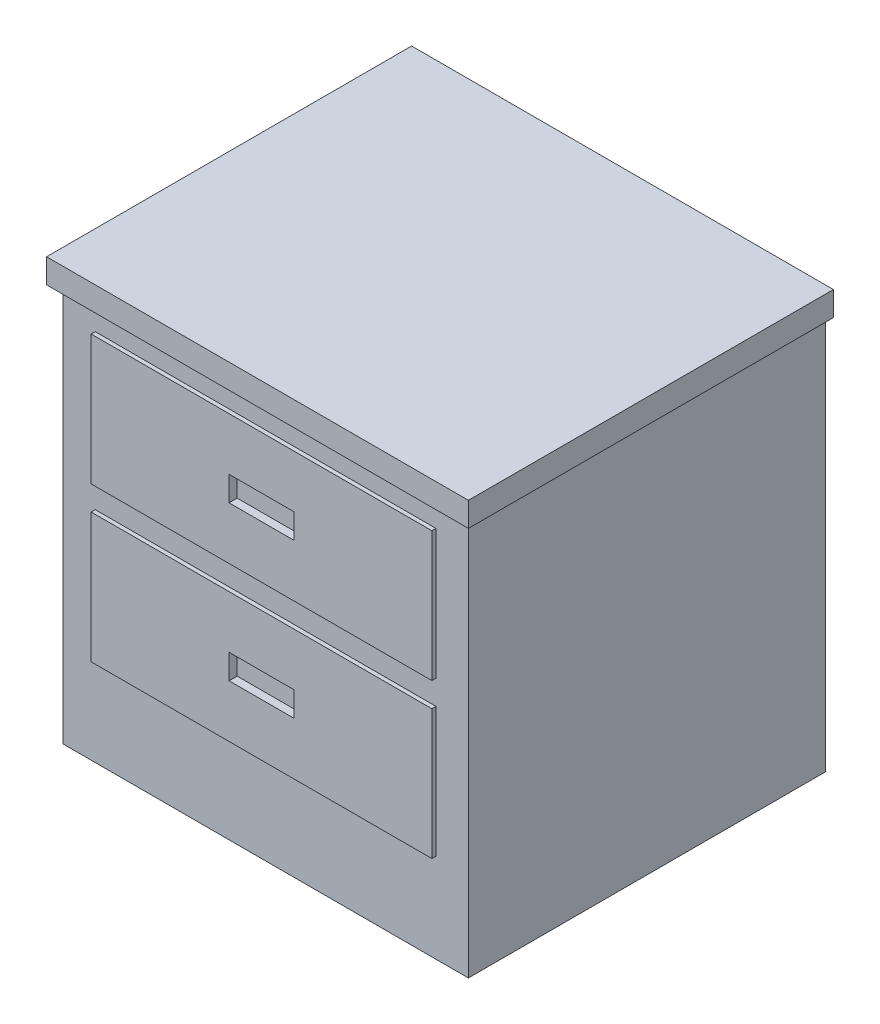
ISO-10303-21;
HEADER;
FILE_DESCRIPTION(('STEP AP214'),'2;1');
FILE_NAME('part.step','',(''),(''),'','','');
FILE_SCHEMA(('AUTOMOTIVE_DESIGN { 1 0 10303 214 1 1 1 1 }'));
ENDSEC;
DATA;
#1=APPLICATION_CONTEXT('core data for automotive mechanical design processes');
#2=APPLICATION_PROTOCOL_DEFINITION('international standard','automotive_design',2000,#1);
#3=PRODUCT_CONTEXT('',#1,'mechanical');
#4=PRODUCT('Part','Part','',(#3));
#5=PRODUCT_RELATED_PRODUCT_CATEGORY('part','',(#4));
#6=PRODUCT_DEFINITION_FORMATION('','',#4);
#7=PRODUCT_DEFINITION_CONTEXT('part definition',#1,'design');
#8=PRODUCT_DEFINITION('design','',#6,#7);
#9=PRODUCT_DEFINITION_SHAPE('','',#8);
#10=(LENGTH_UNIT() NAMED_UNIT(*) SI_UNIT(.MILLI.,.METRE.));
#11=(NAMED_UNIT(*) PLANE_ANGLE_UNIT() SI_UNIT($,.RADIAN.));
#12=(NAMED_UNIT(*) SI_UNIT($,.STERADIAN.) SOLID_ANGLE_UNIT());
#13=UNCERTAINTY_MEASURE_WITH_UNIT(LENGTH_MEASURE(1.E-05),#10,'distance_accuracy_value','');
#14=(GEOMETRIC_REPRESENTATION_CONTEXT(3) GLOBAL_UNCERTAINTY_ASSIGNED_CONTEXT((#13)) GLOBAL_UNIT_ASSIGNED_CONTEXT((#10,
#11,#12)) REPRESENTATION_CONTEXT('',''));
#15=CARTESIAN_POINT('',(0.,0.,0.));
#16=DIRECTION('',(0.,0.,1.));
#17=DIRECTION('',(1.,0.,0.));
#18=AXIS2_PLACEMENT_3D('',#15,#16,#17);
#19=CARTESIAN_POINT('',(-250.,520.,220.));
#20=DIRECTION('',(0.,0.,-1.));
#21=DIRECTION('',(-1.,0.,0.));
#22=AXIS2_PLACEMENT_3D('',#19,#20,#21);
#23=PLANE('',#22);
#24=DIRECTION('',(0.,1.,0.));
#25=VECTOR('',#24,1.);
#26=CARTESIAN_POINT('',(210.,300.,220.));
#27=LINE('',#26,#25);
#28=CARTESIAN_POINT('',(210.,300.,220.));
#29=VERTEX_POINT('',#28);
#30=CARTESIAN_POINT('',(210.,460.,220.));
#31=VERTEX_POINT('',#30);
#32=EDGE_CURVE('E291',#29,#31,#27,.T.);
#33=ORIENTED_EDGE('',*,*,#32,.F.);
#34=DIRECTION('',(1.,0.,0.));
#35=VECTOR('',#34,1.);
#36=CARTESIAN_POINT('',(-210.,300.,220.));
#37=LINE('',#36,#35);
#38=CARTESIAN_POINT('',(-210.,300.,220.));
#39=VERTEX_POINT('',#38);
#40=EDGE_CURVE('E302',#39,#29,#37,.T.);
#41=ORIENTED_EDGE('',*,*,#40,.F.);
#42=DIRECTION('',(0.,-1.,0.));
#43=VECTOR('',#42,1.);
#44=CARTESIAN_POINT('',(-210.,300.,220.));
#45=LINE('',#44,#43);
#46=CARTESIAN_POINT('',(-210.,460.,220.));
#47=VERTEX_POINT('',#46);
#48=EDGE_CURVE('E314',#47,#39,#45,.T.);
#49=ORIENTED_EDGE('',*,*,#48,.F.);
#50=DIRECTION('',(-1.,0.,0.));
#51=VECTOR('',#50,1.);
#52=CARTESIAN_POINT('',(-210.,460.,220.));
#53=LINE('',#52,#51);
#54=EDGE_CURVE('E311',#31,#47,#53,.T.);
#55=ORIENTED_EDGE('',*,*,#54,.F.);
#56=EDGE_LOOP('',(#33,#41,#49,#55));
#57=FACE_BOUND('',#56,.T.);
#58=DIRECTION('',(0.,-1.,0.));
#59=VECTOR('',#58,1.);
#60=CARTESIAN_POINT('',(250.,520.,220.));
#61=LINE('',#60,#59);
#62=CARTESIAN_POINT('',(250.,490.,220.));
#63=VERTEX_POINT('',#62);
#64=CARTESIAN_POINT('',(250.,0.,220.));
#65=VERTEX_POINT('',#64);
#66=EDGE_CURVE('E371',#63,#65,#61,.T.);
#67=ORIENTED_EDGE('',*,*,#66,.F.);
#68=DIRECTION('',(-1.,0.,0.));
#69=VECTOR('',#68,1.);
#70=CARTESIAN_POINT('',(-250.,490.,220.));
#71=LINE('',#70,#69);
#72=CARTESIAN_POINT('',(-250.,490.,220.));
#73=VERTEX_POINT('',#72);
#74=EDGE_CURVE('E11',#63,#73,#71,.T.);
#75=ORIENTED_EDGE('',*,*,#74,.T.);
#76=DIRECTION('',(0.,-1.,0.));
#77=VECTOR('',#76,1.);
#78=CARTESIAN_POINT('',(-250.,520.,220.));
#79=LINE('',#78,#77);
#80=CARTESIAN_POINT('',(-250.,0.,220.));
#81=VERTEX_POINT('',#80);
#82=EDGE_CURVE('E384',#73,#81,#79,.T.);
#83=ORIENTED_EDGE('',*,*,#82,.T.);
#84=DIRECTION('',(1.,0.,0.));
#85=VECTOR('',#84,1.);
#86=CARTESIAN_POINT('',(-250.,0.,220.));
#87=LINE('',#86,#85);
#88=EDGE_CURVE('E372',#81,#65,#87,.T.);
#89=ORIENTED_EDGE('',*,*,#88,.T.);
#90=EDGE_LOOP('',(#67,#75,#83,#89));
#91=FACE_BOUND('',#90,.T.);
#92=DIRECTION('',(0.,1.,0.));
#93=VECTOR('',#92,1.);
#94=CARTESIAN_POINT('',(210.,110.,220.));
#95=LINE('',#94,#93);
#96=CARTESIAN_POINT('',(210.,110.,220.));
#97=VERTEX_POINT('',#96);
#98=CARTESIAN_POINT('',(210.,270.,220.));
#99=VERTEX_POINT('',#98);
#100=EDGE_CURVE('E232',#97,#99,#95,.T.);
#101=ORIENTED_EDGE('',*,*,#100,.F.);
#102=DIRECTION('',(1.,0.,0.));
#103=VECTOR('',#102,1.);
#104=CARTESIAN_POINT('',(-210.,110.,220.));
#105=LINE('',#104,#103);
#106=CARTESIAN_POINT('',(-210.,110.,220.));
#107=VERTEX_POINT('',#106);
#108=EDGE_CURVE('E240',#107,#97,#105,.T.);
#109=ORIENTED_EDGE('',*,*,#108,.F.);
#110=DIRECTION('',(0.,-1.,0.));
#111=VECTOR('',#110,1.);
#112=CARTESIAN_POINT('',(-210.,110.,220.));
#113=LINE('',#112,#111);
#114=CARTESIAN_POINT('',(-210.,270.,220.));
#115=VERTEX_POINT('',#114);
#116=EDGE_CURVE('E250',#115,#107,#113,.T.);
#117=ORIENTED_EDGE('',*,*,#116,.F.);
#118=DIRECTION('',(-1.,0.,0.));
#119=VECTOR('',#118,1.);
#120=CARTESIAN_POINT('',(-210.,270.,220.));
#121=LINE('',#120,#119);
#122=EDGE_CURVE('E59',#99,#115,#121,.T.);
#123=ORIENTED_EDGE('',*,*,#122,.F.);
#124=EDGE_LOOP('',(#101,#109,#117,#123));
#125=FACE_BOUND('',#124,.T.);
#126=ADVANCED_FACE('F36',(#57,#91,#125),#23,.F.);
#127=CARTESIAN_POINT('',(250.,520.,220.));
#128=DIRECTION('',(-1.,0.,0.));
#129=DIRECTION('',(0.,0.,1.));
#130=AXIS2_PLACEMENT_3D('',#127,#128,#129);
#131=PLANE('',#130);
#132=DIRECTION('',(0.,-1.,0.));
#133=VECTOR('',#132,1.);
#134=CARTESIAN_POINT('',(250.,520.,-220.));
#135=LINE('',#134,#133);
#136=CARTESIAN_POINT('',(250.,490.,-220.));
#137=VERTEX_POINT('',#136);
#138=CARTESIAN_POINT('',(250.,0.,-220.));
#139=VERTEX_POINT('',#138);
#140=EDGE_CURVE('E44',#137,#139,#135,.T.);
#141=ORIENTED_EDGE('',*,*,#140,.F.);
#142=DIRECTION('',(0.,0.,1.));
#143=VECTOR('',#142,1.);
#144=CARTESIAN_POINT('',(250.,490.,220.));
#145=LINE('',#144,#143);
#146=EDGE_CURVE('E365',#137,#63,#145,.T.);
#147=ORIENTED_EDGE('',*,*,#146,.T.);
#148=ORIENTED_EDGE('',*,*,#66,.T.);
#149=DIRECTION('',(0.,0.,-1.));
#150=VECTOR('',#149,1.);
#151=CARTESIAN_POINT('',(250.,0.,220.));
#152=LINE('',#151,#150);
#153=EDGE_CURVE('E368',#65,#139,#152,.T.);
#154=ORIENTED_EDGE('',*,*,#153,.T.);
#155=EDGE_LOOP('',(#141,#147,#148,#154));
#156=FACE_BOUND('',#155,.T.);
#157=ADVANCED_FACE('F38',(#156),#131,.F.);
#158=CARTESIAN_POINT('',(-250.,520.,-220.));
#159=DIRECTION('',(0.,0.,1.));
#160=DIRECTION('',(1.,0.,0.));
#161=AXIS2_PLACEMENT_3D('',#158,#159,#160);
#162=PLANE('',#161);
#163=DIRECTION('',(0.,-1.,0.));
#164=VECTOR('',#163,1.);
#165=CARTESIAN_POINT('',(-250.,520.,-220.));
#166=LINE('',#165,#164);
#167=CARTESIAN_POINT('',(-250.,490.,-220.));
#168=VERTEX_POINT('',#167);
#169=CARTESIAN_POINT('',(-250.,0.,-220.));
#170=VERTEX_POINT('',#169);
#171=EDGE_CURVE('E386',#168,#170,#166,.T.);
#172=ORIENTED_EDGE('',*,*,#171,.F.);
#173=DIRECTION('',(-1.,0.,0.));
#174=VECTOR('',#173,1.);
#175=CARTESIAN_POINT('',(-260.,490.,-220.));
#176=LINE('',#175,#174);
#177=CARTESIAN_POINT('',(-260.,490.,-220.));
#178=VERTEX_POINT('',#177);
#179=EDGE_CURVE('E334',#168,#178,#176,.T.);
#180=ORIENTED_EDGE('',*,*,#179,.T.);
#181=DIRECTION('',(0.,1.,0.));
#182=VECTOR('',#181,1.);
#183=CARTESIAN_POINT('',(-260.,490.,-220.));
#184=LINE('',#183,#182);
#185=CARTESIAN_POINT('',(-260.,520.,-220.));
#186=VERTEX_POINT('',#185);
#187=EDGE_CURVE('E358',#178,#186,#184,.T.);
#188=ORIENTED_EDGE('',*,*,#187,.T.);
#189=DIRECTION('',(-1.,0.,0.));
#190=VECTOR('',#189,1.);
#191=CARTESIAN_POINT('',(-250.,520.,-220.));
#192=LINE('',#191,#190);
#193=CARTESIAN_POINT('',(260.,520.,-220.));
#194=VERTEX_POINT('',#193);
#195=EDGE_CURVE('E369',#194,#186,#192,.T.);
#196=ORIENTED_EDGE('',*,*,#195,.F.);
#197=DIRECTION('',(0.,1.,0.));
#198=VECTOR('',#197,1.);
#199=CARTESIAN_POINT('',(260.,490.,-220.));
#200=LINE('',#199,#198);
#201=CARTESIAN_POINT('',(260.,490.,-220.));
#202=VERTEX_POINT('',#201);
#203=EDGE_CURVE('E345',#202,#194,#200,.T.);
#204=ORIENTED_EDGE('',*,*,#203,.F.);
#205=EDGE_CURVE('E336',#202,#137,#176,.T.);
#206=ORIENTED_EDGE('',*,*,#205,.T.);
#207=ORIENTED_EDGE('',*,*,#140,.T.);
#208=DIRECTION('',(-1.,0.,0.));
#209=VECTOR('',#208,1.);
#210=CARTESIAN_POINT('',(-250.,0.,-220.));
#211=LINE('',#210,#209);
#212=EDGE_CURVE('E375',#139,#170,#211,.T.);
#213=ORIENTED_EDGE('',*,*,#212,.T.);
#214=EDGE_LOOP('',(#172,#180,#188,#196,#204,#206,#207,#213));
#215=FACE_BOUND('',#214,.T.);
#216=ADVANCED_FACE('F391',(#215),#162,.F.);
#217=CARTESIAN_POINT('',(-250.,520.,220.));
#218=DIRECTION('',(1.,0.,0.));
#219=DIRECTION('',(0.,0.,-1.));
#220=AXIS2_PLACEMENT_3D('',#217,#218,#219);
#221=PLANE('',#220);
#222=ORIENTED_EDGE('',*,*,#82,.F.);
#223=DIRECTION('',(0.,0.,-1.));
#224=VECTOR('',#223,1.);
#225=CARTESIAN_POINT('',(-250.,490.,220.));
#226=LINE('',#225,#224);
#227=EDGE_CURVE('E355',#73,#168,#226,.T.);
#228=ORIENTED_EDGE('',*,*,#227,.T.);
#229=ORIENTED_EDGE('',*,*,#171,.T.);
#230=DIRECTION('',(0.,0.,1.));
#231=VECTOR('',#230,1.);
#232=CARTESIAN_POINT('',(-250.,0.,220.));
#233=LINE('',#232,#231);
#234=EDGE_CURVE('E378',#170,#81,#233,.T.);
#235=ORIENTED_EDGE('',*,*,#234,.T.);
#236=EDGE_LOOP('',(#222,#228,#229,#235));
#237=FACE_BOUND('',#236,.T.);
#238=ADVANCED_FACE('F403',(#237),#221,.F.);
#239=CARTESIAN_POINT('',(0.,520.,0.));
#240=DIRECTION('',(0.,-1.,0.));
#241=DIRECTION('',(0.,0.,-1.));
#242=AXIS2_PLACEMENT_3D('',#239,#240,#241);
#243=PLANE('',#242);
#244=DIRECTION('',(0.,0.,-1.));
#245=VECTOR('',#244,1.);
#246=CARTESIAN_POINT('',(260.,520.,230.));
#247=LINE('',#246,#245);
#248=CARTESIAN_POINT('',(260.,520.,230.));
#249=VERTEX_POINT('',#248);
#250=EDGE_CURVE('E330',#249,#194,#247,.T.);
#251=ORIENTED_EDGE('',*,*,#250,.T.);
#252=ORIENTED_EDGE('',*,*,#195,.T.);
#253=DIRECTION('',(0.,0.,1.));
#254=VECTOR('',#253,1.);
#255=CARTESIAN_POINT('',(-260.,520.,230.));
#256=LINE('',#255,#254);
#257=CARTESIAN_POINT('',(-260.,520.,230.));
#258=VERTEX_POINT('',#257);
#259=EDGE_CURVE('E348',#186,#258,#256,.T.);
#260=ORIENTED_EDGE('',*,*,#259,.T.);
#261=DIRECTION('',(1.,0.,0.));
#262=VECTOR('',#261,1.);
#263=CARTESIAN_POINT('',(-260.,520.,230.));
#264=LINE('',#263,#262);
#265=EDGE_CURVE('E335',#258,#249,#264,.T.);
#266=ORIENTED_EDGE('',*,*,#265,.T.);
#267=EDGE_LOOP('',(#251,#252,#260,#266));
#268=FACE_BOUND('',#267,.T.);
#269=ADVANCED_FACE('F418',(#268),#243,.F.);
#270=CARTESIAN_POINT('',(0.,0.,0.));
#271=DIRECTION('',(0.,-1.,0.));
#272=DIRECTION('',(0.,0.,-1.));
#273=AXIS2_PLACEMENT_3D('',#270,#271,#272);
#274=PLANE('',#273);
#275=ORIENTED_EDGE('',*,*,#153,.F.);
#276=ORIENTED_EDGE('',*,*,#88,.F.);
#277=ORIENTED_EDGE('',*,*,#234,.F.);
#278=ORIENTED_EDGE('',*,*,#212,.F.);
#279=EDGE_LOOP('',(#275,#276,#277,#278));
#280=FACE_BOUND('',#279,.T.);
#281=ADVANCED_FACE('F397',(#280),#274,.T.);
#282=CARTESIAN_POINT('',(0.,490.,0.));
#283=DIRECTION('',(0.,-1.,0.));
#284=DIRECTION('',(0.,0.,-1.));
#285=AXIS2_PLACEMENT_3D('',#282,#283,#284);
#286=PLANE('',#285);
#287=ORIENTED_EDGE('',*,*,#146,.F.);
#288=ORIENTED_EDGE('',*,*,#205,.F.);
#289=DIRECTION('',(0.,0.,-1.));
#290=VECTOR('',#289,1.);
#291=CARTESIAN_POINT('',(260.,490.,230.));
#292=LINE('',#291,#290);
#293=CARTESIAN_POINT('',(260.,490.,230.));
#294=VERTEX_POINT('',#293);
#295=EDGE_CURVE('E331',#294,#202,#292,.T.);
#296=ORIENTED_EDGE('',*,*,#295,.F.);
#297=DIRECTION('',(1.,0.,0.));
#298=VECTOR('',#297,1.);
#299=CARTESIAN_POINT('',(-260.,490.,230.));
#300=LINE('',#299,#298);
#301=CARTESIAN_POINT('',(-260.,490.,230.));
#302=VERTEX_POINT('',#301);
#303=EDGE_CURVE('E342',#302,#294,#300,.T.);
#304=ORIENTED_EDGE('',*,*,#303,.F.);
#305=DIRECTION('',(0.,0.,1.));
#306=VECTOR('',#305,1.);
#307=CARTESIAN_POINT('',(-260.,490.,230.));
#308=LINE('',#307,#306);
#309=EDGE_CURVE('E339',#178,#302,#308,.T.);
#310=ORIENTED_EDGE('',*,*,#309,.F.);
#311=ORIENTED_EDGE('',*,*,#179,.F.);
#312=ORIENTED_EDGE('',*,*,#227,.F.);
#313=ORIENTED_EDGE('',*,*,#74,.F.);
#314=EDGE_LOOP('',(#287,#288,#296,#304,#310,#311,#312,#313));
#315=FACE_BOUND('',#314,.T.);
#316=ADVANCED_FACE('F411',(#315),#286,.T.);
#317=CARTESIAN_POINT('',(260.,490.,230.));
#318=DIRECTION('',(1.,0.,0.));
#319=DIRECTION('',(0.,0.,-1.));
#320=AXIS2_PLACEMENT_3D('',#317,#318,#319);
#321=PLANE('',#320);
#322=ORIENTED_EDGE('',*,*,#250,.F.);
#323=DIRECTION('',(0.,1.,0.));
#324=VECTOR('',#323,1.);
#325=CARTESIAN_POINT('',(260.,490.,230.));
#326=LINE('',#325,#324);
#327=EDGE_CURVE('E353',#294,#249,#326,.T.);
#328=ORIENTED_EDGE('',*,*,#327,.F.);
#329=ORIENTED_EDGE('',*,*,#295,.T.);
#330=ORIENTED_EDGE('',*,*,#203,.T.);
#331=EDGE_LOOP('',(#322,#328,#329,#330));
#332=FACE_BOUND('',#331,.T.);
#333=ADVANCED_FACE('F420',(#332),#321,.T.);
#334=CARTESIAN_POINT('',(-260.,490.,230.));
#335=DIRECTION('',(0.,0.,1.));
#336=DIRECTION('',(1.,0.,0.));
#337=AXIS2_PLACEMENT_3D('',#334,#335,#336);
#338=PLANE('',#337);
#339=ORIENTED_EDGE('',*,*,#265,.F.);
#340=DIRECTION('',(0.,1.,0.));
#341=VECTOR('',#340,1.);
#342=CARTESIAN_POINT('',(-260.,490.,230.));
#343=LINE('',#342,#341);
#344=EDGE_CURVE('E356',#302,#258,#343,.T.);
#345=ORIENTED_EDGE('',*,*,#344,.F.);
#346=ORIENTED_EDGE('',*,*,#303,.T.);
#347=ORIENTED_EDGE('',*,*,#327,.T.);
#348=EDGE_LOOP('',(#339,#345,#346,#347));
#349=FACE_BOUND('',#348,.T.);
#350=ADVANCED_FACE('F415',(#349),#338,.T.);
#351=CARTESIAN_POINT('',(-260.,490.,230.));
#352=DIRECTION('',(-1.,0.,0.));
#353=DIRECTION('',(0.,0.,1.));
#354=AXIS2_PLACEMENT_3D('',#351,#352,#353);
#355=PLANE('',#354);
#356=ORIENTED_EDGE('',*,*,#259,.F.);
#357=ORIENTED_EDGE('',*,*,#187,.F.);
#358=ORIENTED_EDGE('',*,*,#309,.T.);
#359=ORIENTED_EDGE('',*,*,#344,.T.);
#360=EDGE_LOOP('',(#356,#357,#358,#359));
#361=FACE_BOUND('',#360,.T.);
#362=ADVANCED_FACE('F409',(#361),#355,.T.);
#363=CARTESIAN_POINT('',(210.,300.,225.));
#364=DIRECTION('',(-1.,0.,0.));
#365=DIRECTION('',(0.,0.,1.));
#366=AXIS2_PLACEMENT_3D('',#363,#364,#365);
#367=PLANE('',#366);
#368=ORIENTED_EDGE('',*,*,#32,.T.);
#369=DIRECTION('',(0.,0.,-1.));
#370=VECTOR('',#369,1.);
#371=CARTESIAN_POINT('',(210.,460.,225.));
#372=LINE('',#371,#370);
#373=CARTESIAN_POINT('',(210.,460.,225.));
#374=VERTEX_POINT('',#373);
#375=EDGE_CURVE('E327',#374,#31,#372,.T.);
#376=ORIENTED_EDGE('',*,*,#375,.F.);
#377=DIRECTION('',(0.,1.,0.));
#378=VECTOR('',#377,1.);
#379=CARTESIAN_POINT('',(210.,300.,225.));
#380=LINE('',#379,#378);
#381=CARTESIAN_POINT('',(210.,300.,225.));
#382=VERTEX_POINT('',#381);
#383=EDGE_CURVE('E298',#382,#374,#380,.T.);
#384=ORIENTED_EDGE('',*,*,#383,.F.);
#385=DIRECTION('',(0.,0.,-1.));
#386=VECTOR('',#385,1.);
#387=CARTESIAN_POINT('',(210.,300.,225.));
#388=LINE('',#387,#386);
#389=EDGE_CURVE('E308',#382,#29,#388,.T.);
#390=ORIENTED_EDGE('',*,*,#389,.T.);
#391=EDGE_LOOP('',(#368,#376,#384,#390));
#392=FACE_BOUND('',#391,.T.);
#393=ADVANCED_FACE('F482',(#392),#367,.F.);
#394=CARTESIAN_POINT('',(-210.,460.,225.));
#395=DIRECTION('',(0.,-1.,0.));
#396=DIRECTION('',(0.,0.,-1.));
#397=AXIS2_PLACEMENT_3D('',#394,#395,#396);
#398=PLANE('',#397);
#399=ORIENTED_EDGE('',*,*,#54,.T.);
#400=DIRECTION('',(0.,0.,-1.));
#401=VECTOR('',#400,1.);
#402=CARTESIAN_POINT('',(-210.,460.,225.));
#403=LINE('',#402,#401);
#404=CARTESIAN_POINT('',(-210.,460.,225.));
#405=VERTEX_POINT('',#404);
#406=EDGE_CURVE('E324',#405,#47,#403,.T.);
#407=ORIENTED_EDGE('',*,*,#406,.F.);
#408=DIRECTION('',(-1.,0.,0.));
#409=VECTOR('',#408,1.);
#410=CARTESIAN_POINT('',(-210.,460.,225.));
#411=LINE('',#410,#409);
#412=EDGE_CURVE('E301',#374,#405,#411,.T.);
#413=ORIENTED_EDGE('',*,*,#412,.F.);
#414=ORIENTED_EDGE('',*,*,#375,.T.);
#415=EDGE_LOOP('',(#399,#407,#413,#414));
#416=FACE_BOUND('',#415,.T.);
#417=ADVANCED_FACE('F490',(#416),#398,.F.);
#418=CARTESIAN_POINT('',(-210.,300.,225.));
#419=DIRECTION('',(1.,0.,0.));
#420=DIRECTION('',(0.,0.,-1.));
#421=AXIS2_PLACEMENT_3D('',#418,#419,#420);
#422=PLANE('',#421);
#423=ORIENTED_EDGE('',*,*,#48,.T.);
#424=DIRECTION('',(0.,0.,-1.));
#425=VECTOR('',#424,1.);
#426=CARTESIAN_POINT('',(-210.,300.,225.));
#427=LINE('',#426,#425);
#428=CARTESIAN_POINT('',(-210.,300.,225.));
#429=VERTEX_POINT('',#428);
#430=EDGE_CURVE('E321',#429,#39,#427,.T.);
#431=ORIENTED_EDGE('',*,*,#430,.F.);
#432=DIRECTION('',(0.,-1.,0.));
#433=VECTOR('',#432,1.);
#434=CARTESIAN_POINT('',(-210.,300.,225.));
#435=LINE('',#434,#433);
#436=EDGE_CURVE('E304',#405,#429,#435,.T.);
#437=ORIENTED_EDGE('',*,*,#436,.F.);
#438=ORIENTED_EDGE('',*,*,#406,.T.);
#439=EDGE_LOOP('',(#423,#431,#437,#438));
#440=FACE_BOUND('',#439,.T.);
#441=ADVANCED_FACE('F500',(#440),#422,.F.);
#442=CARTESIAN_POINT('',(-210.,300.,225.));
#443=DIRECTION('',(0.,1.,0.));
#444=DIRECTION('',(0.,0.,1.));
#445=AXIS2_PLACEMENT_3D('',#442,#443,#444);
#446=PLANE('',#445);
#447=ORIENTED_EDGE('',*,*,#40,.T.);
#448=ORIENTED_EDGE('',*,*,#389,.F.);
#449=DIRECTION('',(1.,0.,0.));
#450=VECTOR('',#449,1.);
#451=CARTESIAN_POINT('',(-210.,300.,225.));
#452=LINE('',#451,#450);
#453=EDGE_CURVE('E306',#429,#382,#452,.T.);
#454=ORIENTED_EDGE('',*,*,#453,.F.);
#455=ORIENTED_EDGE('',*,*,#430,.T.);
#456=EDGE_LOOP('',(#447,#448,#454,#455));
#457=FACE_BOUND('',#456,.T.);
#458=ADVANCED_FACE('F510',(#457),#446,.F.);
#459=CARTESIAN_POINT('',(0.,0.,225.));
#460=DIRECTION('',(0.,0.,-1.));
#461=DIRECTION('',(-1.,0.,0.));
#462=AXIS2_PLACEMENT_3D('',#459,#460,#461);
#463=PLANE('',#462);
#464=DIRECTION('',(-1.,0.,0.));
#465=VECTOR('',#464,1.);
#466=CARTESIAN_POINT('',(-40.,395.238095238095,225.));
#467=LINE('',#466,#465);
#468=CARTESIAN_POINT('',(40.,395.238095238095,225.));
#469=VERTEX_POINT('',#468);
#470=CARTESIAN_POINT('',(-40.,395.238095238095,225.));
#471=VERTEX_POINT('',#470);
#472=EDGE_CURVE('E281',#469,#471,#467,.T.);
#473=ORIENTED_EDGE('',*,*,#472,.F.);
#474=DIRECTION('',(0.,1.,0.));
#475=VECTOR('',#474,1.);
#476=CARTESIAN_POINT('',(40.,364.761904761905,225.));
#477=LINE('',#476,#475);
#478=CARTESIAN_POINT('',(40.,364.761904761905,225.));
#479=VERTEX_POINT('',#478);
#480=EDGE_CURVE('E265',#479,#469,#477,.T.);
#481=ORIENTED_EDGE('',*,*,#480,.F.);
#482=DIRECTION('',(1.,0.,0.));
#483=VECTOR('',#482,1.);
#484=CARTESIAN_POINT('',(-40.,364.761904761905,225.));
#485=LINE('',#484,#483);
#486=CARTESIAN_POINT('',(-40.,364.761904761905,225.));
#487=VERTEX_POINT('',#486);
#488=EDGE_CURVE('E270',#487,#479,#485,.T.);
#489=ORIENTED_EDGE('',*,*,#488,.F.);
#490=DIRECTION('',(0.,-1.,0.));
#491=VECTOR('',#490,1.);
#492=CARTESIAN_POINT('',(-40.,364.761904761905,225.));
#493=LINE('',#492,#491);
#494=EDGE_CURVE('E284',#471,#487,#493,.T.);
#495=ORIENTED_EDGE('',*,*,#494,.F.);
#496=EDGE_LOOP('',(#473,#481,#489,#495));
#497=FACE_BOUND('',#496,.T.);
#498=ORIENTED_EDGE('',*,*,#383,.T.);
#499=ORIENTED_EDGE('',*,*,#412,.T.);
#500=ORIENTED_EDGE('',*,*,#436,.T.);
#501=ORIENTED_EDGE('',*,*,#453,.T.);
#502=EDGE_LOOP('',(#498,#499,#500,#501));
#503=FACE_BOUND('',#502,.T.);
#504=ADVANCED_FACE('F520',(#497,#503),#463,.F.);
#505=CARTESIAN_POINT('',(40.,364.761904761905,215.));
#506=DIRECTION('',(1.,0.,0.));
#507=DIRECTION('',(0.,0.,-1.));
#508=AXIS2_PLACEMENT_3D('',#505,#506,#507);
#509=PLANE('',#508);
#510=ORIENTED_EDGE('',*,*,#480,.T.);
#511=DIRECTION('',(0.,0.,1.));
#512=VECTOR('',#511,1.);
#513=CARTESIAN_POINT('',(40.,395.238095238095,215.));
#514=LINE('',#513,#512);
#515=CARTESIAN_POINT('',(40.,395.238095238095,215.));
#516=VERTEX_POINT('',#515);
#517=EDGE_CURVE('E279',#516,#469,#514,.T.);
#518=ORIENTED_EDGE('',*,*,#517,.F.);
#519=DIRECTION('',(0.,1.,0.));
#520=VECTOR('',#519,1.);
#521=CARTESIAN_POINT('',(40.,364.761904761905,215.));
#522=LINE('',#521,#520);
#523=CARTESIAN_POINT('',(40.,364.761904761905,215.));
#524=VERTEX_POINT('',#523);
#525=EDGE_CURVE('E266',#524,#516,#522,.T.);
#526=ORIENTED_EDGE('',*,*,#525,.F.);
#527=DIRECTION('',(0.,0.,1.));
#528=VECTOR('',#527,1.);
#529=CARTESIAN_POINT('',(40.,364.761904761905,215.));
#530=LINE('',#529,#528);
#531=EDGE_CURVE('E289',#524,#479,#530,.T.);
#532=ORIENTED_EDGE('',*,*,#531,.T.);
#533=EDGE_LOOP('',(#510,#518,#526,#532));
#534=FACE_BOUND('',#533,.T.);
#535=ADVANCED_FACE('F530',(#534),#509,.F.);
#536=CARTESIAN_POINT('',(-40.,364.761904761905,215.));
#537=DIRECTION('',(0.,-1.,0.));
#538=DIRECTION('',(0.,0.,-1.));
#539=AXIS2_PLACEMENT_3D('',#536,#537,#538);
#540=PLANE('',#539);
#541=ORIENTED_EDGE('',*,*,#488,.T.);
#542=ORIENTED_EDGE('',*,*,#531,.F.);
#543=DIRECTION('',(1.,0.,0.));
#544=VECTOR('',#543,1.);
#545=CARTESIAN_POINT('',(-40.,364.761904761905,215.));
#546=LINE('',#545,#544);
#547=CARTESIAN_POINT('',(-40.,364.761904761905,215.));
#548=VERTEX_POINT('',#547);
#549=EDGE_CURVE('E276',#548,#524,#546,.T.);
#550=ORIENTED_EDGE('',*,*,#549,.F.);
#551=DIRECTION('',(0.,0.,1.));
#552=VECTOR('',#551,1.);
#553=CARTESIAN_POINT('',(-40.,364.761904761905,215.));
#554=LINE('',#553,#552);
#555=EDGE_CURVE('E292',#548,#487,#554,.T.);
#556=ORIENTED_EDGE('',*,*,#555,.T.);
#557=EDGE_LOOP('',(#541,#542,#550,#556));
#558=FACE_BOUND('',#557,.T.);
#559=ADVANCED_FACE('F540',(#558),#540,.F.);
#560=CARTESIAN_POINT('',(-40.,364.761904761905,215.));
#561=DIRECTION('',(-1.,0.,0.));
#562=DIRECTION('',(0.,0.,1.));
#563=AXIS2_PLACEMENT_3D('',#560,#561,#562);
#564=PLANE('',#563);
#565=ORIENTED_EDGE('',*,*,#494,.T.);
#566=ORIENTED_EDGE('',*,*,#555,.F.);
#567=DIRECTION('',(0.,-1.,0.));
#568=VECTOR('',#567,1.);
#569=CARTESIAN_POINT('',(-40.,364.761904761905,215.));
#570=LINE('',#569,#568);
#571=CARTESIAN_POINT('',(-40.,395.238095238095,215.));
#572=VERTEX_POINT('',#571);
#573=EDGE_CURVE('E273',#572,#548,#570,.T.);
#574=ORIENTED_EDGE('',*,*,#573,.F.);
#575=DIRECTION('',(0.,0.,1.));
#576=VECTOR('',#575,1.);
#577=CARTESIAN_POINT('',(-40.,395.238095238095,215.));
#578=LINE('',#577,#576);
#579=EDGE_CURVE('E294',#572,#471,#578,.T.);
#580=ORIENTED_EDGE('',*,*,#579,.T.);
#581=EDGE_LOOP('',(#565,#566,#574,#580));
#582=FACE_BOUND('',#581,.T.);
#583=ADVANCED_FACE('F550',(#582),#564,.F.);
#584=CARTESIAN_POINT('',(-40.,395.238095238095,215.));
#585=DIRECTION('',(0.,1.,0.));
#586=DIRECTION('',(0.,0.,1.));
#587=AXIS2_PLACEMENT_3D('',#584,#585,#586);
#588=PLANE('',#587);
#589=ORIENTED_EDGE('',*,*,#472,.T.);
#590=ORIENTED_EDGE('',*,*,#579,.F.);
#591=DIRECTION('',(-1.,0.,0.));
#592=VECTOR('',#591,1.);
#593=CARTESIAN_POINT('',(-40.,395.238095238095,215.));
#594=LINE('',#593,#592);
#595=EDGE_CURVE('E269',#516,#572,#594,.T.);
#596=ORIENTED_EDGE('',*,*,#595,.F.);
#597=ORIENTED_EDGE('',*,*,#517,.T.);
#598=EDGE_LOOP('',(#589,#590,#596,#597));
#599=FACE_BOUND('',#598,.T.);
#600=ADVANCED_FACE('F560',(#599),#588,.F.);
#601=CARTESIAN_POINT('',(0.,0.,215.));
#602=DIRECTION('',(0.,0.,-1.));
#603=DIRECTION('',(-1.,0.,0.));
#604=AXIS2_PLACEMENT_3D('',#601,#602,#603);
#605=PLANE('',#604);
#606=ORIENTED_EDGE('',*,*,#525,.T.);
#607=ORIENTED_EDGE('',*,*,#595,.T.);
#608=ORIENTED_EDGE('',*,*,#573,.T.);
#609=ORIENTED_EDGE('',*,*,#549,.T.);
#610=EDGE_LOOP('',(#606,#607,#608,#609));
#611=FACE_BOUND('',#610,.T.);
#612=ADVANCED_FACE('F570',(#611),#605,.F.);
#613=CARTESIAN_POINT('',(210.,110.,225.));
#614=DIRECTION('',(-1.,0.,0.));
#615=DIRECTION('',(0.,0.,1.));
#616=AXIS2_PLACEMENT_3D('',#613,#614,#615);
#617=PLANE('',#616);
#618=ORIENTED_EDGE('',*,*,#100,.T.);
#619=DIRECTION('',(0.,0.,-1.));
#620=VECTOR('',#619,1.);
#621=CARTESIAN_POINT('',(210.,270.,225.));
#622=LINE('',#621,#620);
#623=CARTESIAN_POINT('',(210.,270.,225.));
#624=VERTEX_POINT('',#623);
#625=EDGE_CURVE('E263',#624,#99,#622,.T.);
#626=ORIENTED_EDGE('',*,*,#625,.F.);
#627=DIRECTION('',(0.,1.,0.));
#628=VECTOR('',#627,1.);
#629=CARTESIAN_POINT('',(210.,110.,225.));
#630=LINE('',#629,#628);
#631=CARTESIAN_POINT('',(210.,110.,225.));
#632=VERTEX_POINT('',#631);
#633=EDGE_CURVE('E236',#632,#624,#630,.T.);
#634=ORIENTED_EDGE('',*,*,#633,.F.);
#635=DIRECTION('',(0.,0.,-1.));
#636=VECTOR('',#635,1.);
#637=CARTESIAN_POINT('',(210.,110.,225.));
#638=LINE('',#637,#636);
#639=EDGE_CURVE('E246',#632,#97,#638,.T.);
#640=ORIENTED_EDGE('',*,*,#639,.T.);
#641=EDGE_LOOP('',(#618,#626,#634,#640));
#642=FACE_BOUND('',#641,.T.);
#643=ADVANCED_FACE('F579',(#642),#617,.F.);
#644=CARTESIAN_POINT('',(-210.,270.,225.));
#645=DIRECTION('',(0.,-1.,0.));
#646=DIRECTION('',(0.,0.,-1.));
#647=AXIS2_PLACEMENT_3D('',#644,#645,#646);
#648=PLANE('',#647);
#649=ORIENTED_EDGE('',*,*,#122,.T.);
#650=DIRECTION('',(0.,0.,-1.));
#651=VECTOR('',#650,1.);
#652=CARTESIAN_POINT('',(-210.,270.,225.));
#653=LINE('',#652,#651);
#654=CARTESIAN_POINT('',(-210.,270.,225.));
#655=VERTEX_POINT('',#654);
#656=EDGE_CURVE('E260',#655,#115,#653,.T.);
#657=ORIENTED_EDGE('',*,*,#656,.F.);
#658=DIRECTION('',(-1.,0.,0.));
#659=VECTOR('',#658,1.);
#660=CARTESIAN_POINT('',(-210.,270.,225.));
#661=LINE('',#660,#659);
#662=EDGE_CURVE('E239',#624,#655,#661,.T.);
#663=ORIENTED_EDGE('',*,*,#662,.F.);
#664=ORIENTED_EDGE('',*,*,#625,.T.);
#665=EDGE_LOOP('',(#649,#657,#663,#664));
#666=FACE_BOUND('',#665,.T.);
#667=ADVANCED_FACE('F594',(#666),#648,.F.);
#668=CARTESIAN_POINT('',(-210.,110.,225.));
#669=DIRECTION('',(1.,0.,0.));
#670=DIRECTION('',(0.,0.,-1.));
#671=AXIS2_PLACEMENT_3D('',#668,#669,#670);
#672=PLANE('',#671);
#673=ORIENTED_EDGE('',*,*,#116,.T.);
#674=DIRECTION('',(0.,0.,-1.));
#675=VECTOR('',#674,1.);
#676=CARTESIAN_POINT('',(-210.,110.,225.));
#677=LINE('',#676,#675);
#678=CARTESIAN_POINT('',(-210.,110.,225.));
#679=VERTEX_POINT('',#678);
#680=EDGE_CURVE('E257',#679,#107,#677,.T.);
#681=ORIENTED_EDGE('',*,*,#680,.F.);
#682=DIRECTION('',(0.,-1.,0.));
#683=VECTOR('',#682,1.);
#684=CARTESIAN_POINT('',(-210.,110.,225.));
#685=LINE('',#684,#683);
#686=EDGE_CURVE('E242',#655,#679,#685,.T.);
#687=ORIENTED_EDGE('',*,*,#686,.F.);
#688=ORIENTED_EDGE('',*,*,#656,.T.);
#689=EDGE_LOOP('',(#673,#681,#687,#688));
#690=FACE_BOUND('',#689,.T.);
#691=ADVANCED_FACE('F604',(#690),#672,.F.);
#692=CARTESIAN_POINT('',(-210.,110.,225.));
#693=DIRECTION('',(0.,1.,0.));
#694=DIRECTION('',(0.,0.,1.));
#695=AXIS2_PLACEMENT_3D('',#692,#693,#694);
#696=PLANE('',#695);
#697=ORIENTED_EDGE('',*,*,#108,.T.);
#698=ORIENTED_EDGE('',*,*,#639,.F.);
#699=DIRECTION('',(1.,0.,0.));
#700=VECTOR('',#699,1.);
#701=CARTESIAN_POINT('',(-210.,110.,225.));
#702=LINE('',#701,#700);
#703=EDGE_CURVE('E244',#679,#632,#702,.T.);
#704=ORIENTED_EDGE('',*,*,#703,.F.);
#705=ORIENTED_EDGE('',*,*,#680,.T.);
#706=EDGE_LOOP('',(#697,#698,#704,#705));
#707=FACE_BOUND('',#706,.T.);
#708=ADVANCED_FACE('F614',(#707),#696,.F.);
#709=CARTESIAN_POINT('',(0.,-190.,225.));
#710=DIRECTION('',(0.,0.,-1.));
#711=DIRECTION('',(-1.,0.,0.));
#712=AXIS2_PLACEMENT_3D('',#709,#710,#711);
#713=PLANE('',#712);
#714=DIRECTION('',(-1.,0.,0.));
#715=VECTOR('',#714,1.);
#716=CARTESIAN_POINT('',(-40.,205.238095238095,225.));
#717=LINE('',#716,#715);
#718=CARTESIAN_POINT('',(40.,205.238095238095,225.));
#719=VERTEX_POINT('',#718);
#720=CARTESIAN_POINT('',(-40.,205.238095238095,225.));
#721=VERTEX_POINT('',#720);
#722=EDGE_CURVE('E226',#719,#721,#717,.T.);
#723=ORIENTED_EDGE('',*,*,#722,.F.);
#724=DIRECTION('',(0.,1.,0.));
#725=VECTOR('',#724,1.);
#726=CARTESIAN_POINT('',(40.,174.761904761905,225.));
#727=LINE('',#726,#725);
#728=CARTESIAN_POINT('',(40.,174.761904761905,225.));
#729=VERTEX_POINT('',#728);
#730=EDGE_CURVE('E51',#729,#719,#727,.T.);
#731=ORIENTED_EDGE('',*,*,#730,.F.);
#732=DIRECTION('',(1.,0.,0.));
#733=VECTOR('',#732,1.);
#734=CARTESIAN_POINT('',(-40.,174.761904761905,225.));
#735=LINE('',#734,#733);
#736=CARTESIAN_POINT('',(-40.,174.761904761905,225.));
#737=VERTEX_POINT('',#736);
#738=EDGE_CURVE('E217',#737,#729,#735,.T.);
#739=ORIENTED_EDGE('',*,*,#738,.F.);
#740=DIRECTION('',(0.,-1.,0.));
#741=VECTOR('',#740,1.);
#742=CARTESIAN_POINT('',(-40.,174.761904761905,225.));
#743=LINE('',#742,#741);
#744=EDGE_CURVE('E220',#721,#737,#743,.T.);
#745=ORIENTED_EDGE('',*,*,#744,.F.);
#746=EDGE_LOOP('',(#723,#731,#739,#745));
#747=FACE_BOUND('',#746,.T.);
#748=ORIENTED_EDGE('',*,*,#633,.T.);
#749=ORIENTED_EDGE('',*,*,#662,.T.);
#750=ORIENTED_EDGE('',*,*,#686,.T.);
#751=ORIENTED_EDGE('',*,*,#703,.T.);
#752=EDGE_LOOP('',(#748,#749,#750,#751));
#753=FACE_BOUND('',#752,.T.);
#754=ADVANCED_FACE('F624',(#747,#753),#713,.F.);
#755=CARTESIAN_POINT('',(40.,174.761904761905,215.));
#756=DIRECTION('',(1.,0.,0.));
#757=DIRECTION('',(0.,0.,-1.));
#758=AXIS2_PLACEMENT_3D('',#755,#756,#757);
#759=PLANE('',#758);
#760=ORIENTED_EDGE('',*,*,#730,.T.);
#761=DIRECTION('',(0.,0.,1.));
#762=VECTOR('',#761,1.);
#763=CARTESIAN_POINT('',(40.,205.238095238095,215.));
#764=LINE('',#763,#762);
#765=CARTESIAN_POINT('',(40.,205.238095238095,215.));
#766=VERTEX_POINT('',#765);
#767=EDGE_CURVE('E195',#766,#719,#764,.T.);
#768=ORIENTED_EDGE('',*,*,#767,.F.);
#769=DIRECTION('',(0.,1.,0.));
#770=VECTOR('',#769,1.);
#771=CARTESIAN_POINT('',(40.,174.761904761905,215.));
#772=LINE('',#771,#770);
#773=CARTESIAN_POINT('',(40.,174.761904761905,215.));
#774=VERTEX_POINT('',#773);
#775=EDGE_CURVE('E199',#774,#766,#772,.T.);
#776=ORIENTED_EDGE('',*,*,#775,.F.);
#777=DIRECTION('',(0.,0.,1.));
#778=VECTOR('',#777,1.);
#779=CARTESIAN_POINT('',(40.,174.761904761905,215.));
#780=LINE('',#779,#778);
#781=EDGE_CURVE('E230',#774,#729,#780,.T.);
#782=ORIENTED_EDGE('',*,*,#781,.T.);
#783=EDGE_LOOP('',(#760,#768,#776,#782));
#784=FACE_BOUND('',#783,.T.);
#785=ADVANCED_FACE('F197',(#784),#759,.F.);
#786=CARTESIAN_POINT('',(-40.,174.761904761905,215.));
#787=DIRECTION('',(0.,-1.,0.));
#788=DIRECTION('',(0.,0.,-1.));
#789=AXIS2_PLACEMENT_3D('',#786,#787,#788);
#790=PLANE('',#789);
#791=ORIENTED_EDGE('',*,*,#738,.T.);
#792=ORIENTED_EDGE('',*,*,#781,.F.);
#793=DIRECTION('',(1.,0.,0.));
#794=VECTOR('',#793,1.);
#795=CARTESIAN_POINT('',(-40.,174.761904761905,215.));
#796=LINE('',#795,#794);
#797=CARTESIAN_POINT('',(-40.,174.761904761905,215.));
#798=VERTEX_POINT('',#797);
#799=EDGE_CURVE('E205',#798,#774,#796,.T.);
#800=ORIENTED_EDGE('',*,*,#799,.F.);
#801=DIRECTION('',(0.,0.,1.));
#802=VECTOR('',#801,1.);
#803=CARTESIAN_POINT('',(-40.,174.761904761905,215.));
#804=LINE('',#803,#802);
#805=EDGE_CURVE('E233',#798,#737,#804,.T.);
#806=ORIENTED_EDGE('',*,*,#805,.T.);
#807=EDGE_LOOP('',(#791,#792,#800,#806));
#808=FACE_BOUND('',#807,.T.);
#809=ADVANCED_FACE('F643',(#808),#790,.F.);
#810=CARTESIAN_POINT('',(-40.,174.761904761905,215.));
#811=DIRECTION('',(-1.,0.,0.));
#812=DIRECTION('',(0.,0.,1.));
#813=AXIS2_PLACEMENT_3D('',#810,#811,#812);
#814=PLANE('',#813);
#815=ORIENTED_EDGE('',*,*,#744,.T.);
#816=ORIENTED_EDGE('',*,*,#805,.F.);
#817=DIRECTION('',(0.,-1.,0.));
#818=VECTOR('',#817,1.);
#819=CARTESIAN_POINT('',(-40.,174.761904761905,215.));
#820=LINE('',#819,#818);
#821=CARTESIAN_POINT('',(-40.,205.238095238095,215.));
#822=VERTEX_POINT('',#821);
#823=EDGE_CURVE('E213',#822,#798,#820,.T.);
#824=ORIENTED_EDGE('',*,*,#823,.F.);
#825=DIRECTION('',(0.,0.,1.));
#826=VECTOR('',#825,1.);
#827=CARTESIAN_POINT('',(-40.,205.238095238095,215.));
#828=LINE('',#827,#826);
#829=EDGE_CURVE('E204',#822,#721,#828,.T.);
#830=ORIENTED_EDGE('',*,*,#829,.T.);
#831=EDGE_LOOP('',(#815,#816,#824,#830));
#832=FACE_BOUND('',#831,.T.);
#833=ADVANCED_FACE('F652',(#832),#814,.F.);
#834=CARTESIAN_POINT('',(-40.,205.238095238095,215.));
#835=DIRECTION('',(0.,1.,0.));
#836=DIRECTION('',(0.,0.,1.));
#837=AXIS2_PLACEMENT_3D('',#834,#835,#836);
#838=PLANE('',#837);
#839=ORIENTED_EDGE('',*,*,#722,.T.);
#840=ORIENTED_EDGE('',*,*,#829,.F.);
#841=DIRECTION('',(-1.,0.,0.));
#842=VECTOR('',#841,1.);
#843=CARTESIAN_POINT('',(-40.,205.238095238095,215.));
#844=LINE('',#843,#842);
#845=EDGE_CURVE('E208',#766,#822,#844,.T.);
#846=ORIENTED_EDGE('',*,*,#845,.F.);
#847=ORIENTED_EDGE('',*,*,#767,.T.);
#848=EDGE_LOOP('',(#839,#840,#846,#847));
#849=FACE_BOUND('',#848,.T.);
#850=ADVANCED_FACE('F209',(#849),#838,.F.);
#851=CARTESIAN_POINT('',(0.,-190.,215.));
#852=DIRECTION('',(0.,0.,-1.));
#853=DIRECTION('',(-1.,0.,0.));
#854=AXIS2_PLACEMENT_3D('',#851,#852,#853);
#855=PLANE('',#854);
#856=ORIENTED_EDGE('',*,*,#775,.T.);
#857=ORIENTED_EDGE('',*,*,#845,.T.);
#858=ORIENTED_EDGE('',*,*,#823,.T.);
#859=ORIENTED_EDGE('',*,*,#799,.T.);
#860=EDGE_LOOP('',(#856,#857,#858,#859));
#861=FACE_BOUND('',#860,.T.);
#862=ADVANCED_FACE('F215',(#861),#855,.F.);
#863=CLOSED_SHELL('',(#126,#157,#216,#238,#269,#281,#316,#333,#350,#362,#393,#417,#441,#458,
#504,#535,#559,#583,#600,#612,#643,#667,#691,#708,#754,#785,#809,#833,#850,#862));
#864=MANIFOLD_SOLID_BREP('B2',#863);
#865=ADVANCED_BREP_SHAPE_REPRESENTATION('',(#18,#864),#14);
#866=SHAPE_DEFINITION_REPRESENTATION(#9,#865);
ENDSEC;
END-ISO-10303-21;
